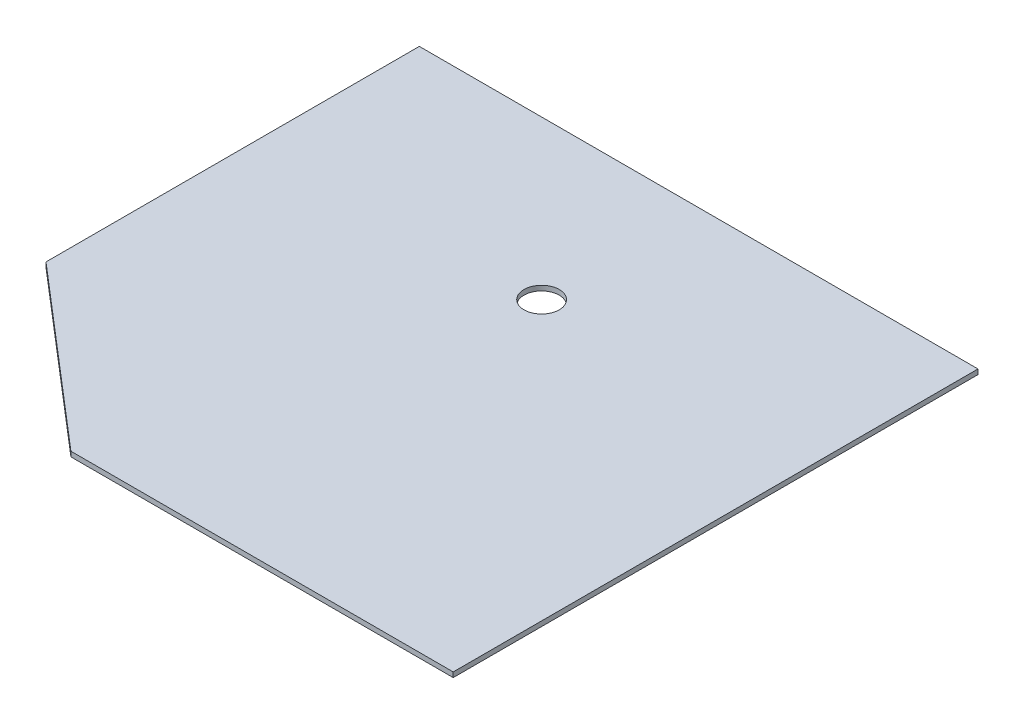
ISO-10303-21;
HEADER;
FILE_DESCRIPTION(('STEP AP214'),'2;1');
FILE_NAME('part.step','',(''),(''),'','','');
FILE_SCHEMA(('AUTOMOTIVE_DESIGN { 1 0 10303 214 1 1 1 1 }'));
ENDSEC;
DATA;
#1=APPLICATION_CONTEXT('core data for automotive mechanical design processes');
#2=APPLICATION_PROTOCOL_DEFINITION('international standard','automotive_design',2000,#1);
#3=PRODUCT_CONTEXT('',#1,'mechanical');
#4=PRODUCT('Part','Part','',(#3));
#5=PRODUCT_RELATED_PRODUCT_CATEGORY('part','',(#4));
#6=PRODUCT_DEFINITION_FORMATION('','',#4);
#7=PRODUCT_DEFINITION_CONTEXT('part definition',#1,'design');
#8=PRODUCT_DEFINITION('design','',#6,#7);
#9=PRODUCT_DEFINITION_SHAPE('','',#8);
#10=(LENGTH_UNIT() NAMED_UNIT(*) SI_UNIT(.MILLI.,.METRE.));
#11=(NAMED_UNIT(*) PLANE_ANGLE_UNIT() SI_UNIT($,.RADIAN.));
#12=(NAMED_UNIT(*) SI_UNIT($,.STERADIAN.) SOLID_ANGLE_UNIT());
#13=UNCERTAINTY_MEASURE_WITH_UNIT(LENGTH_MEASURE(1.E-05),#10,'distance_accuracy_value','');
#14=(GEOMETRIC_REPRESENTATION_CONTEXT(3) GLOBAL_UNCERTAINTY_ASSIGNED_CONTEXT((#13)) GLOBAL_UNIT_ASSIGNED_CONTEXT((#10,
#11,#12)) REPRESENTATION_CONTEXT('',''));
#15=CARTESIAN_POINT('',(0.,0.,0.));
#16=DIRECTION('',(0.,0.,1.));
#17=DIRECTION('',(1.,0.,0.));
#18=AXIS2_PLACEMENT_3D('',#15,#16,#17);
#19=CARTESIAN_POINT('',(0.,4.,0.));
#20=DIRECTION('',(0.,-1.,0.));
#21=DIRECTION('',(0.,0.,-1.));
#22=AXIS2_PLACEMENT_3D('',#19,#20,#21);
#23=PLANE('',#22);
#24=CARTESIAN_POINT('',(13.51495796,4.,-114.81049435994));
#25=DIRECTION('',(0.,-1.,0.));
#26=DIRECTION('',(0.,0.,-1.));
#27=AXIS2_PLACEMENT_3D('',#24,#25,#26);
#28=CIRCLE('',#27,14.275);
#29=CARTESIAN_POINT('',(13.51495796,4.,-129.08549435994));
#30=VERTEX_POINT('',#29);
#31=EDGE_CURVE('E104',#30,#30,#28,.T.);
#32=ORIENTED_EDGE('',*,*,#31,.T.);
#33=EDGE_LOOP('',(#32));
#34=FACE_BOUND('',#33,.T.);
#35=DIRECTION('',(-0.75867507771323,0.,-0.6514692060695));
#36=VECTOR('',#35,1.);
#37=CARTESIAN_POINT('',(-70.791344551651,4.,182.08950564006));
#38=LINE('',#37,#36);
#39=CARTESIAN_POINT('',(-70.791344551651,4.,182.08950564006));
#40=VERTEX_POINT('',#39);
#41=CARTESIAN_POINT('',(-213.64504204,4.,59.4219927340873));
#42=VERTEX_POINT('',#41);
#43=EDGE_CURVE('E99',#40,#42,#38,.T.);
#44=ORIENTED_EDGE('',*,*,#43,.F.);
#45=DIRECTION('',(1.,0.,0.));
#46=VECTOR('',#45,1.);
#47=CARTESIAN_POINT('',(-213.64504204,4.,182.08950564006));
#48=LINE('',#47,#46);
#49=CARTESIAN_POINT('',(238.81495796,4.,182.08950564006));
#50=VERTEX_POINT('',#49);
#51=EDGE_CURVE('E86',#40,#50,#48,.T.);
#52=ORIENTED_EDGE('',*,*,#51,.T.);
#53=DIRECTION('',(0.,0.,-1.));
#54=VECTOR('',#53,1.);
#55=CARTESIAN_POINT('',(238.81495796,4.,182.08950564006));
#56=LINE('',#55,#54);
#57=CARTESIAN_POINT('',(238.81495796,4.,-242.91049435994));
#58=VERTEX_POINT('',#57);
#59=EDGE_CURVE('E135',#50,#58,#56,.T.);
#60=ORIENTED_EDGE('',*,*,#59,.T.);
#61=DIRECTION('',(-1.,0.,0.));
#62=VECTOR('',#61,1.);
#63=CARTESIAN_POINT('',(-213.64504204,4.,-242.91049435994));
#64=LINE('',#63,#62);
#65=CARTESIAN_POINT('',(-213.64504204,4.,-242.91049435994));
#66=VERTEX_POINT('',#65);
#67=EDGE_CURVE('E69',#58,#66,#64,.T.);
#68=ORIENTED_EDGE('',*,*,#67,.T.);
#69=DIRECTION('',(0.,0.,1.));
#70=VECTOR('',#69,1.);
#71=CARTESIAN_POINT('',(-213.64504204,4.,182.08950564006));
#72=LINE('',#71,#70);
#73=EDGE_CURVE('E130',#66,#42,#72,.T.);
#74=ORIENTED_EDGE('',*,*,#73,.T.);
#75=EDGE_LOOP('',(#44,#52,#60,#68,#74));
#76=FACE_BOUND('',#75,.T.);
#77=ADVANCED_FACE('F43',(#34,#76),#23,.F.);
#78=CARTESIAN_POINT('',(0.,0.,0.));
#79=DIRECTION('',(0.,-1.,0.));
#80=DIRECTION('',(0.,0.,-1.));
#81=AXIS2_PLACEMENT_3D('',#78,#79,#80);
#82=PLANE('',#81);
#83=CARTESIAN_POINT('',(13.51495796,0.,-114.81049435994));
#84=DIRECTION('',(0.,-1.,0.));
#85=DIRECTION('',(0.,0.,-1.));
#86=AXIS2_PLACEMENT_3D('',#83,#84,#85);
#87=CIRCLE('',#86,14.275);
#88=CARTESIAN_POINT('',(13.51495796,0.,-129.08549435994));
#89=VERTEX_POINT('',#88);
#90=EDGE_CURVE('E116',#89,#89,#87,.T.);
#91=ORIENTED_EDGE('',*,*,#90,.F.);
#92=EDGE_LOOP('',(#91));
#93=FACE_BOUND('',#92,.T.);
#94=DIRECTION('',(1.,0.,0.));
#95=VECTOR('',#94,1.);
#96=CARTESIAN_POINT('',(-213.64504204,0.,182.08950564006));
#97=LINE('',#96,#95);
#98=CARTESIAN_POINT('',(-70.791344551651,0.,182.08950564006));
#99=VERTEX_POINT('',#98);
#100=CARTESIAN_POINT('',(238.81495796,0.,182.08950564006));
#101=VERTEX_POINT('',#100);
#102=EDGE_CURVE('E113',#99,#101,#97,.T.);
#103=ORIENTED_EDGE('',*,*,#102,.F.);
#104=DIRECTION('',(-0.75867507771323,0.,-0.6514692060695));
#105=VECTOR('',#104,1.);
#106=CARTESIAN_POINT('',(-70.791344551651,0.,182.08950564006));
#107=LINE('',#106,#105);
#108=CARTESIAN_POINT('',(-213.64504204,0.,59.4219927340873));
#109=VERTEX_POINT('',#108);
#110=EDGE_CURVE('E59',#99,#109,#107,.T.);
#111=ORIENTED_EDGE('',*,*,#110,.T.);
#112=DIRECTION('',(0.,0.,1.));
#113=VECTOR('',#112,1.);
#114=CARTESIAN_POINT('',(-213.64504204,0.,182.08950564006));
#115=LINE('',#114,#113);
#116=CARTESIAN_POINT('',(-213.64504204,0.,-242.91049435994));
#117=VERTEX_POINT('',#116);
#118=EDGE_CURVE('E111',#117,#109,#115,.T.);
#119=ORIENTED_EDGE('',*,*,#118,.F.);
#120=DIRECTION('',(-1.,0.,0.));
#121=VECTOR('',#120,1.);
#122=CARTESIAN_POINT('',(-213.64504204,0.,-242.91049435994));
#123=LINE('',#122,#121);
#124=CARTESIAN_POINT('',(238.81495796,0.,-242.91049435994));
#125=VERTEX_POINT('',#124);
#126=EDGE_CURVE('E81',#125,#117,#123,.T.);
#127=ORIENTED_EDGE('',*,*,#126,.F.);
#128=DIRECTION('',(0.,0.,-1.));
#129=VECTOR('',#128,1.);
#130=CARTESIAN_POINT('',(238.81495796,0.,182.08950564006));
#131=LINE('',#130,#129);
#132=EDGE_CURVE('E117',#101,#125,#131,.T.);
#133=ORIENTED_EDGE('',*,*,#132,.F.);
#134=EDGE_LOOP('',(#103,#111,#119,#127,#133));
#135=FACE_BOUND('',#134,.T.);
#136=ADVANCED_FACE('F109',(#93,#135),#82,.T.);
#137=CARTESIAN_POINT('',(-213.64504204,4.,182.08950564006));
#138=DIRECTION('',(1.,0.,0.));
#139=DIRECTION('',(0.,0.,-1.));
#140=AXIS2_PLACEMENT_3D('',#137,#138,#139);
#141=PLANE('',#140);
#142=ORIENTED_EDGE('',*,*,#118,.T.);
#143=DIRECTION('',(0.,1.,0.));
#144=VECTOR('',#143,1.);
#145=CARTESIAN_POINT('',(-213.64504204,0.,59.4219927340873));
#146=LINE('',#145,#144);
#147=EDGE_CURVE('E96',#109,#42,#146,.T.);
#148=ORIENTED_EDGE('',*,*,#147,.T.);
#149=ORIENTED_EDGE('',*,*,#73,.F.);
#150=DIRECTION('',(0.,-1.,0.));
#151=VECTOR('',#150,1.);
#152=CARTESIAN_POINT('',(-213.64504204,4.,-242.91049435994));
#153=LINE('',#152,#151);
#154=EDGE_CURVE('E114',#66,#117,#153,.T.);
#155=ORIENTED_EDGE('',*,*,#154,.T.);
#156=EDGE_LOOP('',(#142,#148,#149,#155));
#157=FACE_BOUND('',#156,.T.);
#158=ADVANCED_FACE('F44',(#157),#141,.F.);
#159=CARTESIAN_POINT('',(-213.64504204,4.,182.08950564006));
#160=DIRECTION('',(0.,0.,-1.));
#161=DIRECTION('',(-1.,0.,0.));
#162=AXIS2_PLACEMENT_3D('',#159,#160,#161);
#163=PLANE('',#162);
#164=ORIENTED_EDGE('',*,*,#51,.F.);
#165=DIRECTION('',(0.,1.,0.));
#166=VECTOR('',#165,1.);
#167=CARTESIAN_POINT('',(-70.791344551651,0.,182.08950564006));
#168=LINE('',#167,#166);
#169=EDGE_CURVE('E102',#99,#40,#168,.T.);
#170=ORIENTED_EDGE('',*,*,#169,.F.);
#171=ORIENTED_EDGE('',*,*,#102,.T.);
#172=DIRECTION('',(0.,-1.,0.));
#173=VECTOR('',#172,1.);
#174=CARTESIAN_POINT('',(238.81495796,4.,182.08950564006));
#175=LINE('',#174,#173);
#176=EDGE_CURVE('E11',#50,#101,#175,.T.);
#177=ORIENTED_EDGE('',*,*,#176,.F.);
#178=EDGE_LOOP('',(#164,#170,#171,#177));
#179=FACE_BOUND('',#178,.T.);
#180=ADVANCED_FACE('F133',(#179),#163,.F.);
#181=CARTESIAN_POINT('',(238.81495796,4.,182.08950564006));
#182=DIRECTION('',(-1.,0.,0.));
#183=DIRECTION('',(0.,0.,1.));
#184=AXIS2_PLACEMENT_3D('',#181,#182,#183);
#185=PLANE('',#184);
#186=ORIENTED_EDGE('',*,*,#132,.T.);
#187=DIRECTION('',(0.,-1.,0.));
#188=VECTOR('',#187,1.);
#189=CARTESIAN_POINT('',(238.81495796,4.,-242.91049435994));
#190=LINE('',#189,#188);
#191=EDGE_CURVE('E51',#58,#125,#190,.T.);
#192=ORIENTED_EDGE('',*,*,#191,.F.);
#193=ORIENTED_EDGE('',*,*,#59,.F.);
#194=ORIENTED_EDGE('',*,*,#176,.T.);
#195=EDGE_LOOP('',(#186,#192,#193,#194));
#196=FACE_BOUND('',#195,.T.);
#197=ADVANCED_FACE('F134',(#196),#185,.F.);
#198=CARTESIAN_POINT('',(-213.64504204,4.,-242.91049435994));
#199=DIRECTION('',(0.,0.,1.));
#200=DIRECTION('',(1.,0.,0.));
#201=AXIS2_PLACEMENT_3D('',#198,#199,#200);
#202=PLANE('',#201);
#203=ORIENTED_EDGE('',*,*,#126,.T.);
#204=ORIENTED_EDGE('',*,*,#154,.F.);
#205=ORIENTED_EDGE('',*,*,#67,.F.);
#206=ORIENTED_EDGE('',*,*,#191,.T.);
#207=EDGE_LOOP('',(#203,#204,#205,#206));
#208=FACE_BOUND('',#207,.T.);
#209=ADVANCED_FACE('F126',(#208),#202,.F.);
#210=CARTESIAN_POINT('',(13.51495796,0.,-114.81049435994));
#211=DIRECTION('',(0.,1.,0.));
#212=DIRECTION('',(0.,0.,1.));
#213=AXIS2_PLACEMENT_3D('',#210,#211,#212);
#214=CYLINDRICAL_SURFACE('',#213,14.275);
#215=ORIENTED_EDGE('',*,*,#90,.T.);
#216=EDGE_LOOP('',(#215));
#217=FACE_BOUND('',#216,.T.);
#218=ORIENTED_EDGE('',*,*,#31,.F.);
#219=EDGE_LOOP('',(#218));
#220=FACE_BOUND('',#219,.T.);
#221=ADVANCED_FACE('F154',(#217,#220),#214,.F.);
#222=CARTESIAN_POINT('',(-70.791344551651,0.,182.08950564006));
#223=DIRECTION('',(0.6514692060695,0.,-0.75867507771323));
#224=DIRECTION('',(-0.75867507771323,0.,-0.6514692060695));
#225=AXIS2_PLACEMENT_3D('',#222,#223,#224);
#226=PLANE('',#225);
#227=ORIENTED_EDGE('',*,*,#43,.T.);
#228=ORIENTED_EDGE('',*,*,#147,.F.);
#229=ORIENTED_EDGE('',*,*,#110,.F.);
#230=ORIENTED_EDGE('',*,*,#169,.T.);
#231=EDGE_LOOP('',(#227,#228,#229,#230));
#232=FACE_BOUND('',#231,.T.);
#233=ADVANCED_FACE('F100',(#232),#226,.F.);
#234=CLOSED_SHELL('',(#77,#136,#158,#180,#197,#209,#221,#233));
#235=MANIFOLD_SOLID_BREP('B2',#234);
#236=ADVANCED_BREP_SHAPE_REPRESENTATION('',(#18,#235),#14);
#237=SHAPE_DEFINITION_REPRESENTATION(#9,#236);
ENDSEC;
END-ISO-10303-21;
